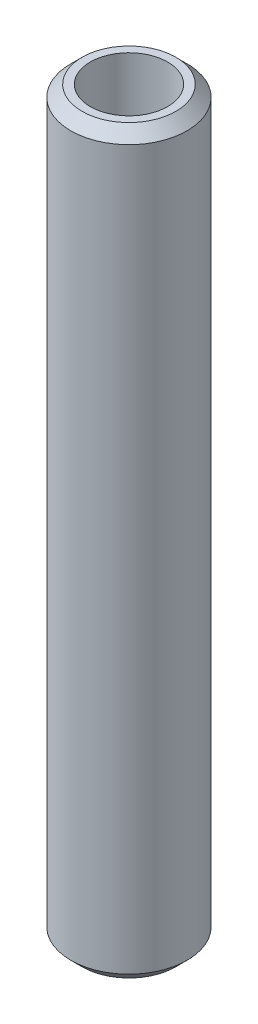
ISO-10303-21;
HEADER;
FILE_DESCRIPTION(('STEP AP214'),'2;1');
FILE_NAME('part.step','',(''),(''),'','','');
FILE_SCHEMA(('AUTOMOTIVE_DESIGN { 1 0 10303 214 1 1 1 1 }'));
ENDSEC;
DATA;
#1=APPLICATION_CONTEXT('core data for automotive mechanical design processes');
#2=APPLICATION_PROTOCOL_DEFINITION('international standard','automotive_design',2000,#1);
#3=PRODUCT_CONTEXT('',#1,'mechanical');
#4=PRODUCT('Part','Part','',(#3));
#5=PRODUCT_RELATED_PRODUCT_CATEGORY('part','',(#4));
#6=PRODUCT_DEFINITION_FORMATION('','',#4);
#7=PRODUCT_DEFINITION_CONTEXT('part definition',#1,'design');
#8=PRODUCT_DEFINITION('design','',#6,#7);
#9=PRODUCT_DEFINITION_SHAPE('','',#8);
#10=(LENGTH_UNIT() NAMED_UNIT(*) SI_UNIT(.MILLI.,.METRE.));
#11=(NAMED_UNIT(*) PLANE_ANGLE_UNIT() SI_UNIT($,.RADIAN.));
#12=(NAMED_UNIT(*) SI_UNIT($,.STERADIAN.) SOLID_ANGLE_UNIT());
#13=UNCERTAINTY_MEASURE_WITH_UNIT(LENGTH_MEASURE(1.E-05),#10,'distance_accuracy_value','');
#14=(GEOMETRIC_REPRESENTATION_CONTEXT(3) GLOBAL_UNCERTAINTY_ASSIGNED_CONTEXT((#13)) GLOBAL_UNIT_ASSIGNED_CONTEXT((#10,
#11,#12)) REPRESENTATION_CONTEXT('',''));
#15=CARTESIAN_POINT('',(0.,0.,0.));
#16=DIRECTION('',(0.,0.,1.));
#17=DIRECTION('',(1.,0.,0.));
#18=AXIS2_PLACEMENT_3D('',#15,#16,#17);
#19=CARTESIAN_POINT('',(0.,254.898957635122,0.));
#20=DIRECTION('',(0.,-1.,0.));
#21=DIRECTION('',(0.,0.,-1.));
#22=AXIS2_PLACEMENT_3D('',#19,#20,#21);
#23=CYLINDRICAL_SURFACE('',#22,20.);
#24=CARTESIAN_POINT('',(0.,251.0374793457,0.));
#25=DIRECTION('',(0.,1.,0.));
#26=DIRECTION('',(0.,0.,1.));
#27=AXIS2_PLACEMENT_3D('',#24,#25,#26);
#28=CIRCLE('',#27,20.);
#29=CARTESIAN_POINT('',(0.,251.0374793457,20.));
#30=VERTEX_POINT('',#29);
#31=EDGE_CURVE('E50',#30,#30,#28,.F.);
#32=ORIENTED_EDGE('',*,*,#31,.T.);
#33=EDGE_LOOP('',(#32));
#34=FACE_BOUND('',#33,.T.);
#35=CARTESIAN_POINT('',(0.,3.86147828942224,0.));
#36=DIRECTION('',(0.,1.,0.));
#37=DIRECTION('',(0.,0.,1.));
#38=AXIS2_PLACEMENT_3D('',#35,#36,#37);
#39=CIRCLE('',#38,20.);
#40=CARTESIAN_POINT('',(0.,3.86147828942224,20.));
#41=VERTEX_POINT('',#40);
#42=EDGE_CURVE('E51',#41,#41,#39,.T.);
#43=ORIENTED_EDGE('',*,*,#42,.T.);
#44=EDGE_LOOP('',(#43));
#45=FACE_BOUND('',#44,.T.);
#46=ADVANCED_FACE('F39',(#34,#45),#23,.T.);
#47=CARTESIAN_POINT('',(0.,254.898957635122,0.));
#48=DIRECTION('',(0.,1.,0.));
#49=DIRECTION('',(0.,0.,1.));
#50=AXIS2_PLACEMENT_3D('',#47,#48,#49);
#51=PLANE('',#50);
#52=CARTESIAN_POINT('',(0.,254.898957635122,0.));
#53=DIRECTION('',(0.,1.,0.));
#54=DIRECTION('',(0.,0.,1.));
#55=AXIS2_PLACEMENT_3D('',#52,#53,#54);
#56=CIRCLE('',#55,16.1385217105778);
#57=CARTESIAN_POINT('',(0.,254.898957635122,16.1385217105778));
#58=VERTEX_POINT('',#57);
#59=EDGE_CURVE('E54',#58,#58,#56,.T.);
#60=ORIENTED_EDGE('',*,*,#59,.T.);
#61=EDGE_LOOP('',(#60));
#62=FACE_BOUND('',#61,.T.);
#63=CARTESIAN_POINT('',(0.,254.898957635122,0.));
#64=DIRECTION('',(0.,1.,0.));
#65=DIRECTION('',(0.,0.,1.));
#66=AXIS2_PLACEMENT_3D('',#63,#64,#65);
#67=CIRCLE('',#66,13.3106040367841);
#68=CARTESIAN_POINT('',(0.,254.898957635122,13.3106040367841));
#69=VERTEX_POINT('',#68);
#70=EDGE_CURVE('E58',#69,#69,#67,.T.);
#71=ORIENTED_EDGE('',*,*,#70,.F.);
#72=EDGE_LOOP('',(#71));
#73=FACE_BOUND('',#72,.T.);
#74=ADVANCED_FACE('F69',(#62,#73),#51,.T.);
#75=CARTESIAN_POINT('',(0.,0.,0.));
#76=DIRECTION('',(0.,1.,0.));
#77=DIRECTION('',(0.,0.,1.));
#78=AXIS2_PLACEMENT_3D('',#75,#76,#77);
#79=PLANE('',#78);
#80=CARTESIAN_POINT('',(0.,0.,0.));
#81=DIRECTION('',(0.,1.,0.));
#82=DIRECTION('',(0.,0.,1.));
#83=AXIS2_PLACEMENT_3D('',#80,#81,#82);
#84=CIRCLE('',#83,16.1385217105778);
#85=CARTESIAN_POINT('',(0.,0.,16.1385217105778));
#86=VERTEX_POINT('',#85);
#87=EDGE_CURVE('E10',#86,#86,#84,.F.);
#88=ORIENTED_EDGE('',*,*,#87,.T.);
#89=EDGE_LOOP('',(#88));
#90=FACE_BOUND('',#89,.T.);
#91=CARTESIAN_POINT('',(0.,0.,0.));
#92=DIRECTION('',(0.,1.,0.));
#93=DIRECTION('',(0.,0.,1.));
#94=AXIS2_PLACEMENT_3D('',#91,#92,#93);
#95=CIRCLE('',#94,13.3106040367841);
#96=CARTESIAN_POINT('',(0.,0.,13.3106040367841));
#97=VERTEX_POINT('',#96);
#98=EDGE_CURVE('E63',#97,#97,#95,.T.);
#99=ORIENTED_EDGE('',*,*,#98,.T.);
#100=EDGE_LOOP('',(#99));
#101=FACE_BOUND('',#100,.T.);
#102=ADVANCED_FACE('F75',(#90,#101),#79,.F.);
#103=CARTESIAN_POINT('',(0.,254.898957635122,0.));
#104=DIRECTION('',(0.,-1.,0.));
#105=DIRECTION('',(0.,0.,-1.));
#106=AXIS2_PLACEMENT_3D('',#103,#104,#105);
#107=CYLINDRICAL_SURFACE('',#106,13.3106040367841);
#108=ORIENTED_EDGE('',*,*,#70,.T.);
#109=EDGE_LOOP('',(#108));
#110=FACE_BOUND('',#109,.T.);
#111=ORIENTED_EDGE('',*,*,#98,.F.);
#112=EDGE_LOOP('',(#111));
#113=FACE_BOUND('',#112,.T.);
#114=ADVANCED_FACE('F70',(#110,#113),#107,.F.);
#115=CARTESIAN_POINT('',(0.,254.898957635122,0.));
#116=DIRECTION('',(0.,-1.,0.));
#117=DIRECTION('',(0.,0.,-1.));
#118=AXIS2_PLACEMENT_3D('',#115,#116,#117);
#119=CONICAL_SURFACE('',#118,16.1385217105778,0.785398163397443);
#120=ORIENTED_EDGE('',*,*,#31,.F.);
#121=EDGE_LOOP('',(#120));
#122=FACE_BOUND('',#121,.T.);
#123=ORIENTED_EDGE('',*,*,#59,.F.);
#124=EDGE_LOOP('',(#123));
#125=FACE_BOUND('',#124,.T.);
#126=ADVANCED_FACE('F81',(#122,#125),#119,.T.);
#127=CARTESIAN_POINT('',(0.,3.86147828942224,0.));
#128=DIRECTION('',(0.,1.,0.));
#129=DIRECTION('',(0.,0.,1.));
#130=AXIS2_PLACEMENT_3D('',#127,#128,#129);
#131=CONICAL_SURFACE('',#130,20.,0.78539816339745);
#132=CARTESIAN_POINT('',(0.,0.,16.1385217105778));
#133=CARTESIAN_POINT('',(0.,0.0402237321814817,16.1787454427592));
#134=CARTESIAN_POINT('',(0.,0.0804474643629632,16.2189691749407));
#135=CARTESIAN_POINT('',(0.,0.160894928725926,16.2994166393037));
#136=CARTESIAN_POINT('',(0.,0.201118660907408,16.3396403714852));
#137=CARTESIAN_POINT('',(0.,0.281566125270371,16.4200878358481));
#138=CARTESIAN_POINT('',(0.,0.321789857451852,16.4603115680296));
#139=CARTESIAN_POINT('',(0.,0.402237321814816,16.5407590323926));
#140=CARTESIAN_POINT('',(0.,0.442461053996298,16.5809827645741));
#141=CARTESIAN_POINT('',(0.,0.522908518359261,16.661430228937));
#142=CARTESIAN_POINT('',(0.,0.563132250540742,16.7016539611185));
#143=CARTESIAN_POINT('',(0.,0.643579714903706,16.7821014254815));
#144=CARTESIAN_POINT('',(0.,0.683803447085188,16.8223251576629));
#145=CARTESIAN_POINT('',(0.,0.764250911448151,16.9027726220259));
#146=CARTESIAN_POINT('',(0.,0.804474643629632,16.9429963542074));
#147=CARTESIAN_POINT('',(0.,0.884922107992595,17.0234438185703));
#148=CARTESIAN_POINT('',(0.,0.925145840174078,17.0636675507518));
#149=CARTESIAN_POINT('',(0.,1.00559330453704,17.1441150151148));
#150=CARTESIAN_POINT('',(0.,1.04581703671852,17.1843387472963));
#151=CARTESIAN_POINT('',(0.,1.12626450108149,17.2647862116592));
#152=CARTESIAN_POINT('',(0.,1.16648823326297,17.3050099438407));
#153=CARTESIAN_POINT('',(0.,1.24693569762593,17.3854574082037));
#154=CARTESIAN_POINT('',(0.,1.28715942980741,17.4256811403852));
#155=CARTESIAN_POINT('',(0.,1.36760689417038,17.5061286047481));
#156=CARTESIAN_POINT('',(0.,1.40783062635186,17.5463523369296));
#157=CARTESIAN_POINT('',(0.,1.48827809071482,17.6267998012926));
#158=CARTESIAN_POINT('',(0.,1.5285018228963,17.6670235334741));
#159=CARTESIAN_POINT('',(0.,1.60894928725927,17.747470997837));
#160=CARTESIAN_POINT('',(0.,1.64917301944075,17.7876947300185));
#161=CARTESIAN_POINT('',(0.,1.72962048380371,17.8681421943815));
#162=CARTESIAN_POINT('',(0.,1.76984421598519,17.908365926563));
#163=CARTESIAN_POINT('',(0.,1.85029168034815,17.9888133909259));
#164=CARTESIAN_POINT('',(0.,1.89051541252964,18.0290371231074));
#165=CARTESIAN_POINT('',(0.,1.9709628768926,18.1094845874704));
#166=CARTESIAN_POINT('',(0.,2.01118660907408,18.1497083196518));
#167=CARTESIAN_POINT('',(0.,2.09163407343705,18.2301557840148));
#168=CARTESIAN_POINT('',(0.,2.13185780561853,18.2703795161963));
#169=CARTESIAN_POINT('',(0.,2.21230526998149,18.3508269805592));
#170=CARTESIAN_POINT('',(0.,2.25252900216297,18.3910507127407));
#171=CARTESIAN_POINT('',(0.,2.33297646652594,18.4714981771037));
#172=CARTESIAN_POINT('',(0.,2.37320019870742,18.5117219092852));
#173=CARTESIAN_POINT('',(0.,2.45364766307038,18.5921693736481));
#174=CARTESIAN_POINT('',(0.,2.49387139525186,18.6323931058296));
#175=CARTESIAN_POINT('',(0.,2.57431885961483,18.7128405701926));
#176=CARTESIAN_POINT('',(0.,2.61454259179631,18.7530643023741));
#177=CARTESIAN_POINT('',(0.,2.69499005615927,18.833511766737));
#178=CARTESIAN_POINT('',(0.,2.73521378834075,18.8737354989185));
#179=CARTESIAN_POINT('',(0.,2.81566125270371,18.9541829632815));
#180=CARTESIAN_POINT('',(0.,2.8558849848852,18.994406695463));
#181=CARTESIAN_POINT('',(0.,2.93633244924816,19.0748541598259));
#182=CARTESIAN_POINT('',(0.,2.97655618142964,19.1150778920074));
#183=CARTESIAN_POINT('',(0.,3.0570036457926,19.1955253563704));
#184=CARTESIAN_POINT('',(0.,3.09722737797409,19.2357490885518));
#185=CARTESIAN_POINT('',(0.,3.17767484233705,19.3161965529148));
#186=CARTESIAN_POINT('',(0.,3.21789857451853,19.3564202850963));
#187=CARTESIAN_POINT('',(0.,3.29834603888149,19.4368677494593));
#188=CARTESIAN_POINT('',(0.,3.33856977106298,19.4770914816407));
#189=CARTESIAN_POINT('',(0.,3.41901723542594,19.5575389460037));
#190=CARTESIAN_POINT('',(0.,3.45924096760742,19.5977626781852));
#191=CARTESIAN_POINT('',(0.,3.53968843197038,19.6782101425481));
#192=CARTESIAN_POINT('',(0.,3.57991216415187,19.7184338747296));
#193=CARTESIAN_POINT('',(0.,3.66035962851483,19.7988813390926));
#194=CARTESIAN_POINT('',(0.,3.70058336069631,19.8391050712741));
#195=CARTESIAN_POINT('',(0.,3.78103082505927,19.919552535637));
#196=CARTESIAN_POINT('',(0.,3.82125455724076,19.9597762678185));
#197=CARTESIAN_POINT('',(0.,3.86147828942224,20.));
#198=B_SPLINE_CURVE_WITH_KNOTS('',3,(#132,#133,#134,#135,#136,#137,#138,#139,#140,#141,#142,
#143,#144,#145,#146,#147,#148,#149,#150,#151,#152,#153,#154,#155,#156,#157,#158,#159,#160,#161,
#162,#163,#164,#165,#166,#167,#168,#169,#170,#171,#172,#173,#174,#175,#176,#177,#178,#179,#180,
#181,#182,#183,#184,#185,#186,#187,#188,#189,#190,#191,#192,#193,#194,#195,#196,#197),
.UNSPECIFIED.,.F.,.F.,(4,2,2,2,2,2,2,2,2,2,2,2,2,2,2,2,2,2,2,2,2,2,2,2,2,2,2,2,2,2,2,2,4),(0.,
0.170654842740942,0.341309685481887,0.511964528222831,0.682619370963774,0.853274213704718,
1.02392905644566,1.19458389918661,1.36523874192755,1.53589358466849,1.70654842740944,
1.87720327015038,2.04785811289132,2.21851295563227,2.38916779837321,2.55982264111415,
2.7304774838551,2.90113232659604,3.07178716933699,3.24244201207793,3.41309685481887,
3.58375169755982,3.75440654030076,3.9250613830417,4.09571622578265,4.26637106852359,
4.43702591126453,4.60768075400548,4.77833559674642,4.94899043948736,5.11964528222831,
5.29030012496925,5.4609549677102),.UNSPECIFIED.);
#199=EDGE_CURVE('BSEAM45',#86,#41,#198,.T.);
#200=ORIENTED_EDGE('',*,*,#87,.F.);
#201=ORIENTED_EDGE('',*,*,#42,.F.);
#202=ORIENTED_EDGE('',*,*,#199,.T.);
#203=ORIENTED_EDGE('',*,*,#199,.F.);
#204=EDGE_LOOP('',(#200,#202,#201,#203));
#205=FACE_BOUND('',#204,.T.);
#206=ADVANCED_FACE('F45',(#205),#131,.T.);
#207=CLOSED_SHELL('',(#46,#74,#102,#114,#126,#206));
#208=MANIFOLD_SOLID_BREP('B2',#207);
#209=ADVANCED_BREP_SHAPE_REPRESENTATION('',(#18,#208),#14);
#210=SHAPE_DEFINITION_REPRESENTATION(#9,#209);
ENDSEC;
END-ISO-10303-21;
